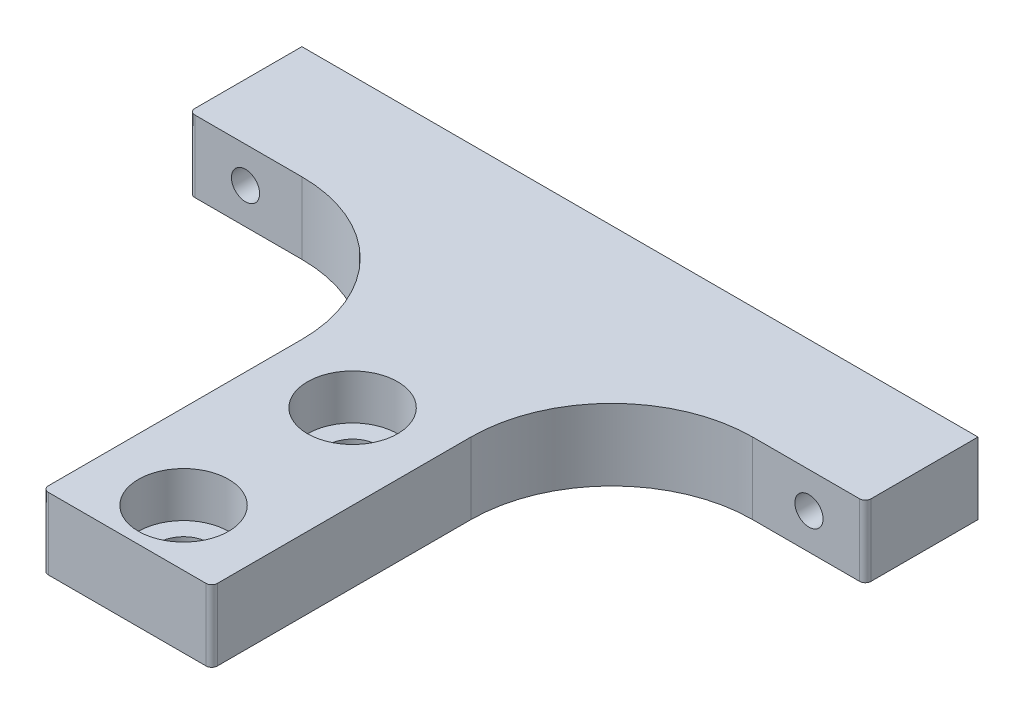
ISO-10303-21;
HEADER;
FILE_DESCRIPTION(('STEP AP214'),'2;1');
FILE_NAME('part.step','',(''),(''),'','','');
FILE_SCHEMA(('AUTOMOTIVE_DESIGN { 1 0 10303 214 1 1 1 1 }'));
ENDSEC;
DATA;
#1=APPLICATION_CONTEXT('core data for automotive mechanical design processes');
#2=APPLICATION_PROTOCOL_DEFINITION('international standard','automotive_design',2000,#1);
#3=PRODUCT_CONTEXT('',#1,'mechanical');
#4=PRODUCT('Part','Part','',(#3));
#5=PRODUCT_RELATED_PRODUCT_CATEGORY('part','',(#4));
#6=PRODUCT_DEFINITION_FORMATION('','',#4);
#7=PRODUCT_DEFINITION_CONTEXT('part definition',#1,'design');
#8=PRODUCT_DEFINITION('design','',#6,#7);
#9=PRODUCT_DEFINITION_SHAPE('','',#8);
#10=(LENGTH_UNIT() NAMED_UNIT(*) SI_UNIT(.MILLI.,.METRE.));
#11=(NAMED_UNIT(*) PLANE_ANGLE_UNIT() SI_UNIT($,.RADIAN.));
#12=(NAMED_UNIT(*) SI_UNIT($,.STERADIAN.) SOLID_ANGLE_UNIT());
#13=UNCERTAINTY_MEASURE_WITH_UNIT(LENGTH_MEASURE(1.E-05),#10,'distance_accuracy_value','');
#14=(GEOMETRIC_REPRESENTATION_CONTEXT(3) GLOBAL_UNCERTAINTY_ASSIGNED_CONTEXT((#13)) GLOBAL_UNIT_ASSIGNED_CONTEXT((#10,
#11,#12)) REPRESENTATION_CONTEXT('',''));
#15=CARTESIAN_POINT('',(0.,0.,0.));
#16=DIRECTION('',(0.,0.,1.));
#17=DIRECTION('',(1.,0.,0.));
#18=AXIS2_PLACEMENT_3D('',#15,#16,#17);
#19=CARTESIAN_POINT('',(-30.,6.35,0.));
#20=DIRECTION('',(0.,0.,1.));
#21=DIRECTION('',(1.,0.,0.));
#22=AXIS2_PLACEMENT_3D('',#19,#20,#21);
#23=PLANE('',#22);
#24=DIRECTION('',(-1.,0.,0.));
#25=VECTOR('',#24,1.);
#26=CARTESIAN_POINT('',(-30.,0.,0.));
#27=LINE('',#26,#25);
#28=CARTESIAN_POINT('',(30.,0.,0.));
#29=VERTEX_POINT('',#28);
#30=CARTESIAN_POINT('',(-30.,0.,0.));
#31=VERTEX_POINT('',#30);
#32=EDGE_CURVE('E187',#29,#31,#27,.T.);
#33=ORIENTED_EDGE('',*,*,#32,.T.);
#34=DIRECTION('',(0.,-1.,0.));
#35=VECTOR('',#34,1.);
#36=CARTESIAN_POINT('',(-30.,6.35,0.));
#37=LINE('',#36,#35);
#38=CARTESIAN_POINT('',(-30.,6.35,0.));
#39=VERTEX_POINT('',#38);
#40=EDGE_CURVE('E164',#39,#31,#37,.T.);
#41=ORIENTED_EDGE('',*,*,#40,.F.);
#42=DIRECTION('',(-1.,0.,0.));
#43=VECTOR('',#42,1.);
#44=CARTESIAN_POINT('',(-30.,6.35,0.));
#45=LINE('',#44,#43);
#46=CARTESIAN_POINT('',(30.,6.35,0.));
#47=VERTEX_POINT('',#46);
#48=EDGE_CURVE('E146',#47,#39,#45,.T.);
#49=ORIENTED_EDGE('',*,*,#48,.F.);
#50=DIRECTION('',(0.,-1.,0.));
#51=VECTOR('',#50,1.);
#52=CARTESIAN_POINT('',(30.,6.35,0.));
#53=LINE('',#52,#51);
#54=EDGE_CURVE('E157',#47,#29,#53,.T.);
#55=ORIENTED_EDGE('',*,*,#54,.T.);
#56=EDGE_LOOP('',(#33,#41,#49,#55));
#57=FACE_BOUND('',#56,.T.);
#58=CARTESIAN_POINT('',(25.,3.175,0.));
#59=DIRECTION('',(0.,0.,-1.));
#60=DIRECTION('',(-1.,0.,0.));
#61=AXIS2_PLACEMENT_3D('',#58,#59,#60);
#62=CIRCLE('',#61,1.24999999999999);
#63=CARTESIAN_POINT('',(23.75,3.175,0.));
#64=VERTEX_POINT('',#63);
#65=EDGE_CURVE('E504',#64,#64,#62,.T.);
#66=ORIENTED_EDGE('',*,*,#65,.F.);
#67=EDGE_LOOP('',(#66));
#68=FACE_BOUND('',#67,.T.);
#69=CARTESIAN_POINT('',(-25.,3.175,0.));
#70=DIRECTION('',(0.,0.,-1.));
#71=DIRECTION('',(-1.,0.,0.));
#72=AXIS2_PLACEMENT_3D('',#69,#70,#71);
#73=CIRCLE('',#72,1.24999999999999);
#74=CARTESIAN_POINT('',(-26.25,3.175,0.));
#75=VERTEX_POINT('',#74);
#76=EDGE_CURVE('E505',#75,#75,#73,.T.);
#77=ORIENTED_EDGE('',*,*,#76,.F.);
#78=EDGE_LOOP('',(#77));
#79=FACE_BOUND('',#78,.T.);
#80=ADVANCED_FACE('F39',(#57,#68,#79),#23,.F.);
#81=CARTESIAN_POINT('',(-7.5,6.35,10.));
#82=DIRECTION('',(1.,0.,0.));
#83=DIRECTION('',(0.,0.,-1.));
#84=AXIS2_PLACEMENT_3D('',#81,#82,#83);
#85=PLANE('',#84);
#86=DIRECTION('',(0.,0.,1.));
#87=VECTOR('',#86,1.);
#88=CARTESIAN_POINT('',(-7.5,0.,10.));
#89=LINE('',#88,#87);
#90=CARTESIAN_POINT('',(-7.5,0.,22.5));
#91=VERTEX_POINT('',#90);
#92=CARTESIAN_POINT('',(-7.49999999999999,0.,45.));
#93=VERTEX_POINT('',#92);
#94=EDGE_CURVE('E176',#91,#93,#89,.T.);
#95=ORIENTED_EDGE('',*,*,#94,.T.);
#96=DIRECTION('',(0.,-1.,0.));
#97=VECTOR('',#96,1.);
#98=CARTESIAN_POINT('',(-7.49999999999999,6.35,45.));
#99=LINE('',#98,#97);
#100=CARTESIAN_POINT('',(-7.49999999999999,6.35,45.));
#101=VERTEX_POINT('',#100);
#102=EDGE_CURVE('E11',#93,#101,#99,.F.);
#103=ORIENTED_EDGE('',*,*,#102,.T.);
#104=DIRECTION('',(0.,0.,1.));
#105=VECTOR('',#104,1.);
#106=CARTESIAN_POINT('',(-7.5,6.35,10.));
#107=LINE('',#106,#105);
#108=CARTESIAN_POINT('',(-7.5,6.35,22.5));
#109=VERTEX_POINT('',#108);
#110=EDGE_CURVE('E194',#109,#101,#107,.T.);
#111=ORIENTED_EDGE('',*,*,#110,.F.);
#112=DIRECTION('',(0.,-1.,0.));
#113=VECTOR('',#112,1.);
#114=CARTESIAN_POINT('',(-7.5,0.,22.5));
#115=LINE('',#114,#113);
#116=EDGE_CURVE('E201',#109,#91,#115,.T.);
#117=ORIENTED_EDGE('',*,*,#116,.T.);
#118=EDGE_LOOP('',(#95,#103,#111,#117));
#119=FACE_BOUND('',#118,.T.);
#120=ADVANCED_FACE('F266',(#119),#85,.F.);
#121=CARTESIAN_POINT('',(-7.49999999999999,6.35,45.5));
#122=DIRECTION('',(0.,0.,-1.));
#123=DIRECTION('',(-1.,0.,0.));
#124=AXIS2_PLACEMENT_3D('',#121,#122,#123);
#125=PLANE('',#124);
#126=DIRECTION('',(1.,0.,0.));
#127=VECTOR('',#126,1.);
#128=CARTESIAN_POINT('',(-7.49999999999999,0.,45.5));
#129=LINE('',#128,#127);
#130=CARTESIAN_POINT('',(-6.99999999999999,0.,45.5));
#131=VERTEX_POINT('',#130);
#132=CARTESIAN_POINT('',(7.,0.,45.5));
#133=VERTEX_POINT('',#132);
#134=EDGE_CURVE('E178',#131,#133,#129,.T.);
#135=ORIENTED_EDGE('',*,*,#134,.T.);
#136=DIRECTION('',(0.,-1.,0.));
#137=VECTOR('',#136,1.);
#138=CARTESIAN_POINT('',(7.,6.35,45.5));
#139=LINE('',#138,#137);
#140=CARTESIAN_POINT('',(7.,6.35,45.5));
#141=VERTEX_POINT('',#140);
#142=EDGE_CURVE('E60',#133,#141,#139,.F.);
#143=ORIENTED_EDGE('',*,*,#142,.T.);
#144=DIRECTION('',(1.,0.,0.));
#145=VECTOR('',#144,1.);
#146=CARTESIAN_POINT('',(-7.49999999999999,6.35,45.5));
#147=LINE('',#146,#145);
#148=CARTESIAN_POINT('',(-6.99999999999999,6.35,45.5));
#149=VERTEX_POINT('',#148);
#150=EDGE_CURVE('E248',#149,#141,#147,.T.);
#151=ORIENTED_EDGE('',*,*,#150,.F.);
#152=DIRECTION('',(0.,-1.,0.));
#153=VECTOR('',#152,1.);
#154=CARTESIAN_POINT('',(-6.99999999999999,6.35,45.5));
#155=LINE('',#154,#153);
#156=EDGE_CURVE('E240',#149,#131,#155,.T.);
#157=ORIENTED_EDGE('',*,*,#156,.T.);
#158=EDGE_LOOP('',(#135,#143,#151,#157));
#159=FACE_BOUND('',#158,.T.);
#160=ADVANCED_FACE('F261',(#159),#125,.F.);
#161=CARTESIAN_POINT('',(7.5,6.35,10.));
#162=DIRECTION('',(-1.,0.,0.));
#163=DIRECTION('',(0.,0.,1.));
#164=AXIS2_PLACEMENT_3D('',#161,#162,#163);
#165=PLANE('',#164);
#166=DIRECTION('',(0.,0.,-1.));
#167=VECTOR('',#166,1.);
#168=CARTESIAN_POINT('',(7.5,6.35,10.));
#169=LINE('',#168,#167);
#170=CARTESIAN_POINT('',(7.50000000000001,6.35,45.));
#171=VERTEX_POINT('',#170);
#172=CARTESIAN_POINT('',(7.5,6.35,22.5));
#173=VERTEX_POINT('',#172);
#174=EDGE_CURVE('E247',#171,#173,#169,.T.);
#175=ORIENTED_EDGE('',*,*,#174,.F.);
#176=DIRECTION('',(0.,-1.,0.));
#177=VECTOR('',#176,1.);
#178=CARTESIAN_POINT('',(7.50000000000001,6.35,45.));
#179=LINE('',#178,#177);
#180=CARTESIAN_POINT('',(7.50000000000001,0.,45.));
#181=VERTEX_POINT('',#180);
#182=EDGE_CURVE('E233',#171,#181,#179,.T.);
#183=ORIENTED_EDGE('',*,*,#182,.T.);
#184=DIRECTION('',(0.,0.,-1.));
#185=VECTOR('',#184,1.);
#186=CARTESIAN_POINT('',(7.5,0.,10.));
#187=LINE('',#186,#185);
#188=CARTESIAN_POINT('',(7.5,0.,22.5));
#189=VERTEX_POINT('',#188);
#190=EDGE_CURVE('E181',#181,#189,#187,.T.);
#191=ORIENTED_EDGE('',*,*,#190,.T.);
#192=DIRECTION('',(0.,-1.,0.));
#193=VECTOR('',#192,1.);
#194=CARTESIAN_POINT('',(7.5,6.35,22.5));
#195=LINE('',#194,#193);
#196=EDGE_CURVE('E198',#189,#173,#195,.F.);
#197=ORIENTED_EDGE('',*,*,#196,.T.);
#198=EDGE_LOOP('',(#175,#183,#191,#197));
#199=FACE_BOUND('',#198,.T.);
#200=ADVANCED_FACE('F252',(#199),#165,.F.);
#201=CARTESIAN_POINT('',(30.,6.35,9.99999999999999));
#202=DIRECTION('',(0.,0.,-1.));
#203=DIRECTION('',(-1.,0.,0.));
#204=AXIS2_PLACEMENT_3D('',#201,#202,#203);
#205=PLANE('',#204);
#206=CARTESIAN_POINT('',(25.,3.175,9.99999999999999));
#207=DIRECTION('',(0.,0.,-1.));
#208=DIRECTION('',(-1.,0.,0.));
#209=AXIS2_PLACEMENT_3D('',#206,#207,#208);
#210=CIRCLE('',#209,1.25);
#211=CARTESIAN_POINT('',(23.75,3.175,9.99999999999999));
#212=VERTEX_POINT('',#211);
#213=EDGE_CURVE('E508',#212,#212,#210,.T.);
#214=ORIENTED_EDGE('',*,*,#213,.T.);
#215=EDGE_LOOP('',(#214));
#216=FACE_BOUND('',#215,.T.);
#217=DIRECTION('',(1.,0.,0.));
#218=VECTOR('',#217,1.);
#219=CARTESIAN_POINT('',(30.,0.,9.99999999999999));
#220=LINE('',#219,#218);
#221=CARTESIAN_POINT('',(20.,0.,10.));
#222=VERTEX_POINT('',#221);
#223=CARTESIAN_POINT('',(29.5,0.,9.99999999999999));
#224=VERTEX_POINT('',#223);
#225=EDGE_CURVE('E183',#222,#224,#220,.T.);
#226=ORIENTED_EDGE('',*,*,#225,.T.);
#227=DIRECTION('',(0.,-1.,0.));
#228=VECTOR('',#227,1.);
#229=CARTESIAN_POINT('',(29.5,6.35,9.99999999999999));
#230=LINE('',#229,#228);
#231=CARTESIAN_POINT('',(29.5,6.35,9.99999999999999));
#232=VERTEX_POINT('',#231);
#233=EDGE_CURVE('E223',#224,#232,#230,.F.);
#234=ORIENTED_EDGE('',*,*,#233,.T.);
#235=DIRECTION('',(1.,0.,0.));
#236=VECTOR('',#235,1.);
#237=CARTESIAN_POINT('',(30.,6.35,9.99999999999999));
#238=LINE('',#237,#236);
#239=CARTESIAN_POINT('',(20.,6.35,10.));
#240=VERTEX_POINT('',#239);
#241=EDGE_CURVE('E154',#240,#232,#238,.T.);
#242=ORIENTED_EDGE('',*,*,#241,.F.);
#243=DIRECTION('',(0.,-1.,0.));
#244=VECTOR('',#243,1.);
#245=CARTESIAN_POINT('',(20.,0.,10.));
#246=LINE('',#245,#244);
#247=EDGE_CURVE('E163',#240,#222,#246,.T.);
#248=ORIENTED_EDGE('',*,*,#247,.T.);
#249=EDGE_LOOP('',(#226,#234,#242,#248));
#250=FACE_BOUND('',#249,.T.);
#251=ADVANCED_FACE('F295',(#216,#250),#205,.F.);
#252=CARTESIAN_POINT('',(30.,6.35,0.));
#253=DIRECTION('',(-1.,0.,0.));
#254=DIRECTION('',(0.,0.,1.));
#255=AXIS2_PLACEMENT_3D('',#252,#253,#254);
#256=PLANE('',#255);
#257=DIRECTION('',(0.,0.,-1.));
#258=VECTOR('',#257,1.);
#259=CARTESIAN_POINT('',(30.,6.35,0.));
#260=LINE('',#259,#258);
#261=CARTESIAN_POINT('',(30.,6.35,9.49999999999999));
#262=VERTEX_POINT('',#261);
#263=EDGE_CURVE('E141',#262,#47,#260,.T.);
#264=ORIENTED_EDGE('',*,*,#263,.F.);
#265=DIRECTION('',(0.,-1.,0.));
#266=VECTOR('',#265,1.);
#267=CARTESIAN_POINT('',(30.,6.35,9.49999999999999));
#268=LINE('',#267,#266);
#269=CARTESIAN_POINT('',(30.,0.,9.49999999999999));
#270=VERTEX_POINT('',#269);
#271=EDGE_CURVE('E217',#262,#270,#268,.T.);
#272=ORIENTED_EDGE('',*,*,#271,.T.);
#273=DIRECTION('',(0.,0.,-1.));
#274=VECTOR('',#273,1.);
#275=CARTESIAN_POINT('',(30.,0.,0.));
#276=LINE('',#275,#274);
#277=EDGE_CURVE('E160',#270,#29,#276,.T.);
#278=ORIENTED_EDGE('',*,*,#277,.T.);
#279=ORIENTED_EDGE('',*,*,#54,.F.);
#280=EDGE_LOOP('',(#264,#272,#278,#279));
#281=FACE_BOUND('',#280,.T.);
#282=ADVANCED_FACE('F158',(#281),#256,.F.);
#283=CARTESIAN_POINT('',(-30.,6.35,0.));
#284=DIRECTION('',(1.,0.,0.));
#285=DIRECTION('',(0.,0.,-1.));
#286=AXIS2_PLACEMENT_3D('',#283,#284,#285);
#287=PLANE('',#286);
#288=DIRECTION('',(0.,0.,1.));
#289=VECTOR('',#288,1.);
#290=CARTESIAN_POINT('',(-30.,0.,0.));
#291=LINE('',#290,#289);
#292=CARTESIAN_POINT('',(-30.,0.,9.5));
#293=VERTEX_POINT('',#292);
#294=EDGE_CURVE('E189',#31,#293,#291,.T.);
#295=ORIENTED_EDGE('',*,*,#294,.T.);
#296=DIRECTION('',(0.,-1.,0.));
#297=VECTOR('',#296,1.);
#298=CARTESIAN_POINT('',(-30.,6.35,9.5));
#299=LINE('',#298,#297);
#300=CARTESIAN_POINT('',(-30.,6.35,9.5));
#301=VERTEX_POINT('',#300);
#302=EDGE_CURVE('E231',#293,#301,#299,.F.);
#303=ORIENTED_EDGE('',*,*,#302,.T.);
#304=DIRECTION('',(0.,0.,1.));
#305=VECTOR('',#304,1.);
#306=CARTESIAN_POINT('',(-30.,6.35,0.));
#307=LINE('',#306,#305);
#308=EDGE_CURVE('E169',#39,#301,#307,.T.);
#309=ORIENTED_EDGE('',*,*,#308,.F.);
#310=ORIENTED_EDGE('',*,*,#40,.T.);
#311=EDGE_LOOP('',(#295,#303,#309,#310));
#312=FACE_BOUND('',#311,.T.);
#313=ADVANCED_FACE('F283',(#312),#287,.F.);
#314=CARTESIAN_POINT('',(-30.,6.35,10.));
#315=DIRECTION('',(0.,0.,-1.));
#316=DIRECTION('',(-1.,0.,0.));
#317=AXIS2_PLACEMENT_3D('',#314,#315,#316);
#318=PLANE('',#317);
#319=CARTESIAN_POINT('',(-25.,3.175,10.));
#320=DIRECTION('',(0.,0.,-1.));
#321=DIRECTION('',(-1.,0.,0.));
#322=AXIS2_PLACEMENT_3D('',#319,#320,#321);
#323=CIRCLE('',#322,1.25);
#324=CARTESIAN_POINT('',(-26.25,3.175,10.));
#325=VERTEX_POINT('',#324);
#326=EDGE_CURVE('E503',#325,#325,#323,.T.);
#327=ORIENTED_EDGE('',*,*,#326,.T.);
#328=EDGE_LOOP('',(#327));
#329=FACE_BOUND('',#328,.T.);
#330=DIRECTION('',(1.,0.,0.));
#331=VECTOR('',#330,1.);
#332=CARTESIAN_POINT('',(-30.,6.35,10.));
#333=LINE('',#332,#331);
#334=CARTESIAN_POINT('',(-29.5,6.35,10.));
#335=VERTEX_POINT('',#334);
#336=CARTESIAN_POINT('',(-20.,6.35,10.));
#337=VERTEX_POINT('',#336);
#338=EDGE_CURVE('E171',#335,#337,#333,.T.);
#339=ORIENTED_EDGE('',*,*,#338,.F.);
#340=DIRECTION('',(0.,-1.,0.));
#341=VECTOR('',#340,1.);
#342=CARTESIAN_POINT('',(-29.5,6.35,10.));
#343=LINE('',#342,#341);
#344=CARTESIAN_POINT('',(-29.5,0.,10.));
#345=VERTEX_POINT('',#344);
#346=EDGE_CURVE('E228',#335,#345,#343,.T.);
#347=ORIENTED_EDGE('',*,*,#346,.T.);
#348=DIRECTION('',(1.,0.,0.));
#349=VECTOR('',#348,1.);
#350=CARTESIAN_POINT('',(-30.,0.,10.));
#351=LINE('',#350,#349);
#352=CARTESIAN_POINT('',(-20.,0.,10.));
#353=VERTEX_POINT('',#352);
#354=EDGE_CURVE('E192',#345,#353,#351,.T.);
#355=ORIENTED_EDGE('',*,*,#354,.T.);
#356=DIRECTION('',(0.,-1.,0.));
#357=VECTOR('',#356,1.);
#358=CARTESIAN_POINT('',(-20.,6.35,10.));
#359=LINE('',#358,#357);
#360=EDGE_CURVE('E204',#353,#337,#359,.F.);
#361=ORIENTED_EDGE('',*,*,#360,.T.);
#362=EDGE_LOOP('',(#339,#347,#355,#361));
#363=FACE_BOUND('',#362,.T.);
#364=ADVANCED_FACE('F276',(#329,#363),#318,.F.);
#365=CARTESIAN_POINT('',(0.,6.35,0.));
#366=DIRECTION('',(0.,1.,0.));
#367=DIRECTION('',(0.,0.,1.));
#368=AXIS2_PLACEMENT_3D('',#365,#366,#367);
#369=PLANE('',#368);
#370=CARTESIAN_POINT('',(0.,6.35,25.5));
#371=DIRECTION('',(0.,1.,0.));
#372=DIRECTION('',(0.,0.,1.));
#373=AXIS2_PLACEMENT_3D('',#370,#371,#372);
#374=CIRCLE('',#373,4.);
#375=CARTESIAN_POINT('',(0.,6.35,29.5));
#376=VERTEX_POINT('',#375);
#377=EDGE_CURVE('E515',#376,#376,#374,.T.);
#378=ORIENTED_EDGE('',*,*,#377,.F.);
#379=EDGE_LOOP('',(#378));
#380=FACE_BOUND('',#379,.T.);
#381=CARTESIAN_POINT('',(0.,6.35,40.5));
#382=DIRECTION('',(0.,1.,0.));
#383=DIRECTION('',(0.,0.,1.));
#384=AXIS2_PLACEMENT_3D('',#381,#382,#383);
#385=CIRCLE('',#384,4.);
#386=CARTESIAN_POINT('',(0.,6.35,44.5));
#387=VERTEX_POINT('',#386);
#388=EDGE_CURVE('E527',#387,#387,#385,.T.);
#389=ORIENTED_EDGE('',*,*,#388,.F.);
#390=EDGE_LOOP('',(#389));
#391=FACE_BOUND('',#390,.T.);
#392=ORIENTED_EDGE('',*,*,#150,.T.);
#393=CARTESIAN_POINT('',(7.00000000000001,6.35,45.));
#394=DIRECTION('',(0.,1.,0.));
#395=DIRECTION('',(0.,0.,1.));
#396=AXIS2_PLACEMENT_3D('',#393,#394,#395);
#397=CIRCLE('',#396,0.5);
#398=EDGE_CURVE('E47',#141,#171,#397,.T.);
#399=ORIENTED_EDGE('',*,*,#398,.T.);
#400=ORIENTED_EDGE('',*,*,#174,.T.);
#401=CARTESIAN_POINT('',(20.,6.35,22.5));
#402=DIRECTION('',(0.,1.,0.));
#403=DIRECTION('',(0.,0.,1.));
#404=AXIS2_PLACEMENT_3D('',#401,#402,#403);
#405=CIRCLE('',#404,12.5);
#406=EDGE_CURVE('E210',#173,#240,#405,.F.);
#407=ORIENTED_EDGE('',*,*,#406,.T.);
#408=ORIENTED_EDGE('',*,*,#241,.T.);
#409=CARTESIAN_POINT('',(29.5,6.35,9.49999999999999));
#410=DIRECTION('',(0.,1.,0.));
#411=DIRECTION('',(0.,0.,1.));
#412=AXIS2_PLACEMENT_3D('',#409,#410,#411);
#413=CIRCLE('',#412,0.5);
#414=EDGE_CURVE('E150',#232,#262,#413,.T.);
#415=ORIENTED_EDGE('',*,*,#414,.T.);
#416=ORIENTED_EDGE('',*,*,#263,.T.);
#417=ORIENTED_EDGE('',*,*,#48,.T.);
#418=ORIENTED_EDGE('',*,*,#308,.T.);
#419=CARTESIAN_POINT('',(-29.5,6.35,9.5));
#420=DIRECTION('',(0.,1.,0.));
#421=DIRECTION('',(0.,0.,1.));
#422=AXIS2_PLACEMENT_3D('',#419,#420,#421);
#423=CIRCLE('',#422,0.5);
#424=EDGE_CURVE('E225',#301,#335,#423,.T.);
#425=ORIENTED_EDGE('',*,*,#424,.T.);
#426=ORIENTED_EDGE('',*,*,#338,.T.);
#427=CARTESIAN_POINT('',(-20.,6.35,22.5));
#428=DIRECTION('',(0.,1.,0.));
#429=DIRECTION('',(0.,0.,1.));
#430=AXIS2_PLACEMENT_3D('',#427,#428,#429);
#431=CIRCLE('',#430,12.5);
#432=EDGE_CURVE('E215',#337,#109,#431,.F.);
#433=ORIENTED_EDGE('',*,*,#432,.T.);
#434=ORIENTED_EDGE('',*,*,#110,.T.);
#435=CARTESIAN_POINT('',(-6.99999999999999,6.35,45.));
#436=DIRECTION('',(0.,1.,0.));
#437=DIRECTION('',(0.,0.,1.));
#438=AXIS2_PLACEMENT_3D('',#435,#436,#437);
#439=CIRCLE('',#438,0.5);
#440=EDGE_CURVE('E244',#101,#149,#439,.T.);
#441=ORIENTED_EDGE('',*,*,#440,.T.);
#442=EDGE_LOOP('',(#392,#399,#400,#407,#408,#415,#416,#417,#418,#425,#426,#433,#434,#441));
#443=FACE_BOUND('',#442,.T.);
#444=ADVANCED_FACE('F143',(#380,#391,#443),#369,.T.);
#445=CARTESIAN_POINT('',(0.,0.,0.));
#446=DIRECTION('',(0.,1.,0.));
#447=DIRECTION('',(0.,0.,1.));
#448=AXIS2_PLACEMENT_3D('',#445,#446,#447);
#449=PLANE('',#448);
#450=CARTESIAN_POINT('',(0.,0.,25.5));
#451=DIRECTION('',(0.,1.,0.));
#452=DIRECTION('',(0.,0.,1.));
#453=AXIS2_PLACEMENT_3D('',#450,#451,#452);
#454=CIRCLE('',#453,2.25);
#455=CARTESIAN_POINT('',(0.,0.,27.75));
#456=VERTEX_POINT('',#455);
#457=EDGE_CURVE('E524',#456,#456,#454,.T.);
#458=ORIENTED_EDGE('',*,*,#457,.T.);
#459=EDGE_LOOP('',(#458));
#460=FACE_BOUND('',#459,.T.);
#461=CARTESIAN_POINT('',(0.,0.,40.5));
#462=DIRECTION('',(0.,1.,0.));
#463=DIRECTION('',(0.,0.,1.));
#464=AXIS2_PLACEMENT_3D('',#461,#462,#463);
#465=CIRCLE('',#464,2.25);
#466=CARTESIAN_POINT('',(0.,0.,42.75));
#467=VERTEX_POINT('',#466);
#468=EDGE_CURVE('E179',#467,#467,#465,.T.);
#469=ORIENTED_EDGE('',*,*,#468,.T.);
#470=EDGE_LOOP('',(#469));
#471=FACE_BOUND('',#470,.T.);
#472=ORIENTED_EDGE('',*,*,#190,.F.);
#473=CARTESIAN_POINT('',(7.00000000000001,0.,45.));
#474=DIRECTION('',(0.,1.,0.));
#475=DIRECTION('',(0.,0.,1.));
#476=AXIS2_PLACEMENT_3D('',#473,#474,#475);
#477=CIRCLE('',#476,0.5);
#478=EDGE_CURVE('E238',#181,#133,#477,.F.);
#479=ORIENTED_EDGE('',*,*,#478,.T.);
#480=ORIENTED_EDGE('',*,*,#134,.F.);
#481=CARTESIAN_POINT('',(-6.99999999999999,0.,45.));
#482=DIRECTION('',(0.,1.,0.));
#483=DIRECTION('',(0.,0.,1.));
#484=AXIS2_PLACEMENT_3D('',#481,#482,#483);
#485=CIRCLE('',#484,0.5);
#486=EDGE_CURVE('E236',#131,#93,#485,.F.);
#487=ORIENTED_EDGE('',*,*,#486,.T.);
#488=ORIENTED_EDGE('',*,*,#94,.F.);
#489=CARTESIAN_POINT('',(-20.,0.,22.5));
#490=DIRECTION('',(0.,1.,0.));
#491=DIRECTION('',(0.,0.,1.));
#492=AXIS2_PLACEMENT_3D('',#489,#490,#491);
#493=CIRCLE('',#492,12.5);
#494=EDGE_CURVE('E212',#91,#353,#493,.T.);
#495=ORIENTED_EDGE('',*,*,#494,.T.);
#496=ORIENTED_EDGE('',*,*,#354,.F.);
#497=CARTESIAN_POINT('',(-29.5,0.,9.5));
#498=DIRECTION('',(0.,1.,0.));
#499=DIRECTION('',(0.,0.,1.));
#500=AXIS2_PLACEMENT_3D('',#497,#498,#499);
#501=CIRCLE('',#500,0.5);
#502=EDGE_CURVE('E219',#345,#293,#501,.F.);
#503=ORIENTED_EDGE('',*,*,#502,.T.);
#504=ORIENTED_EDGE('',*,*,#294,.F.);
#505=ORIENTED_EDGE('',*,*,#32,.F.);
#506=ORIENTED_EDGE('',*,*,#277,.F.);
#507=CARTESIAN_POINT('',(29.5,0.,9.49999999999999));
#508=DIRECTION('',(0.,1.,0.));
#509=DIRECTION('',(0.,0.,1.));
#510=AXIS2_PLACEMENT_3D('',#507,#508,#509);
#511=CIRCLE('',#510,0.5);
#512=EDGE_CURVE('E221',#270,#224,#511,.F.);
#513=ORIENTED_EDGE('',*,*,#512,.T.);
#514=ORIENTED_EDGE('',*,*,#225,.F.);
#515=CARTESIAN_POINT('',(20.,0.,22.5));
#516=DIRECTION('',(0.,1.,0.));
#517=DIRECTION('',(0.,0.,1.));
#518=AXIS2_PLACEMENT_3D('',#515,#516,#517);
#519=CIRCLE('',#518,12.5);
#520=EDGE_CURVE('E207',#222,#189,#519,.T.);
#521=ORIENTED_EDGE('',*,*,#520,.T.);
#522=EDGE_LOOP('',(#472,#479,#480,#487,#488,#495,#496,#503,#504,#505,#506,#513,#514,#521));
#523=FACE_BOUND('',#522,.T.);
#524=ADVANCED_FACE('F260',(#460,#471,#523),#449,.F.);
#525=CARTESIAN_POINT('',(20.,6.35,22.5));
#526=DIRECTION('',(0.,1.,0.));
#527=DIRECTION('',(0.,0.,1.));
#528=AXIS2_PLACEMENT_3D('',#525,#526,#527);
#529=CYLINDRICAL_SURFACE('',#528,12.5);
#530=ORIENTED_EDGE('',*,*,#406,.F.);
#531=ORIENTED_EDGE('',*,*,#196,.F.);
#532=ORIENTED_EDGE('',*,*,#520,.F.);
#533=ORIENTED_EDGE('',*,*,#247,.F.);
#534=EDGE_LOOP('',(#530,#531,#532,#533));
#535=FACE_BOUND('',#534,.T.);
#536=ADVANCED_FACE('F297',(#535),#529,.F.);
#537=CARTESIAN_POINT('',(-20.,6.35,22.5));
#538=DIRECTION('',(0.,1.,0.));
#539=DIRECTION('',(0.,0.,1.));
#540=AXIS2_PLACEMENT_3D('',#537,#538,#539);
#541=CYLINDRICAL_SURFACE('',#540,12.5);
#542=ORIENTED_EDGE('',*,*,#432,.F.);
#543=ORIENTED_EDGE('',*,*,#360,.F.);
#544=ORIENTED_EDGE('',*,*,#494,.F.);
#545=ORIENTED_EDGE('',*,*,#116,.F.);
#546=EDGE_LOOP('',(#542,#543,#544,#545));
#547=FACE_BOUND('',#546,.T.);
#548=ADVANCED_FACE('F270',(#547),#541,.F.);
#549=CARTESIAN_POINT('',(0.,6.35,40.5));
#550=DIRECTION('',(0.,1.,0.));
#551=DIRECTION('',(0.,0.,1.));
#552=AXIS2_PLACEMENT_3D('',#549,#550,#551);
#553=CYLINDRICAL_SURFACE('',#552,2.25);
#554=ORIENTED_EDGE('',*,*,#468,.F.);
#555=EDGE_LOOP('',(#554));
#556=FACE_BOUND('',#555,.T.);
#557=CARTESIAN_POINT('',(0.,2.35,40.5));
#558=DIRECTION('',(0.,1.,0.));
#559=DIRECTION('',(0.,0.,1.));
#560=AXIS2_PLACEMENT_3D('',#557,#558,#559);
#561=CIRCLE('',#560,2.25);
#562=CARTESIAN_POINT('',(0.,2.35,42.75));
#563=VERTEX_POINT('',#562);
#564=EDGE_CURVE('E532',#563,#563,#561,.T.);
#565=ORIENTED_EDGE('',*,*,#564,.T.);
#566=EDGE_LOOP('',(#565));
#567=FACE_BOUND('',#566,.T.);
#568=ADVANCED_FACE('F303',(#556,#567),#553,.F.);
#569=CARTESIAN_POINT('',(2.25,2.35,40.5));
#570=DIRECTION('',(0.,-1.,0.));
#571=DIRECTION('',(0.,0.,-1.));
#572=AXIS2_PLACEMENT_3D('',#569,#570,#571);
#573=PLANE('',#572);
#574=ORIENTED_EDGE('',*,*,#564,.F.);
#575=EDGE_LOOP('',(#574));
#576=FACE_BOUND('',#575,.T.);
#577=CARTESIAN_POINT('',(0.,2.35,40.5));
#578=DIRECTION('',(0.,1.,0.));
#579=DIRECTION('',(0.,0.,1.));
#580=AXIS2_PLACEMENT_3D('',#577,#578,#579);
#581=CIRCLE('',#580,4.);
#582=CARTESIAN_POINT('',(0.,2.35,44.5));
#583=VERTEX_POINT('',#582);
#584=EDGE_CURVE('E530',#583,#583,#581,.T.);
#585=ORIENTED_EDGE('',*,*,#584,.T.);
#586=EDGE_LOOP('',(#585));
#587=FACE_BOUND('',#586,.T.);
#588=ADVANCED_FACE('F435',(#576,#587),#573,.F.);
#589=CARTESIAN_POINT('',(0.,6.35,40.5));
#590=DIRECTION('',(0.,1.,0.));
#591=DIRECTION('',(0.,0.,1.));
#592=AXIS2_PLACEMENT_3D('',#589,#590,#591);
#593=CYLINDRICAL_SURFACE('',#592,4.);
#594=ORIENTED_EDGE('',*,*,#584,.F.);
#595=EDGE_LOOP('',(#594));
#596=FACE_BOUND('',#595,.T.);
#597=ORIENTED_EDGE('',*,*,#388,.T.);
#598=EDGE_LOOP('',(#597));
#599=FACE_BOUND('',#598,.T.);
#600=ADVANCED_FACE('F426',(#596,#599),#593,.F.);
#601=CARTESIAN_POINT('',(0.,6.35,25.5));
#602=DIRECTION('',(0.,1.,0.));
#603=DIRECTION('',(0.,0.,1.));
#604=AXIS2_PLACEMENT_3D('',#601,#602,#603);
#605=CYLINDRICAL_SURFACE('',#604,2.25);
#606=ORIENTED_EDGE('',*,*,#457,.F.);
#607=EDGE_LOOP('',(#606));
#608=FACE_BOUND('',#607,.T.);
#609=CARTESIAN_POINT('',(0.,2.35,25.5));
#610=DIRECTION('',(0.,1.,0.));
#611=DIRECTION('',(0.,0.,1.));
#612=AXIS2_PLACEMENT_3D('',#609,#610,#611);
#613=CIRCLE('',#612,2.25);
#614=CARTESIAN_POINT('',(0.,2.35,27.75));
#615=VERTEX_POINT('',#614);
#616=EDGE_CURVE('E521',#615,#615,#613,.T.);
#617=ORIENTED_EDGE('',*,*,#616,.T.);
#618=EDGE_LOOP('',(#617));
#619=FACE_BOUND('',#618,.T.);
#620=ADVANCED_FACE('F417',(#608,#619),#605,.F.);
#621=CARTESIAN_POINT('',(2.25,2.35,25.5));
#622=DIRECTION('',(0.,-1.,0.));
#623=DIRECTION('',(0.,0.,-1.));
#624=AXIS2_PLACEMENT_3D('',#621,#622,#623);
#625=PLANE('',#624);
#626=ORIENTED_EDGE('',*,*,#616,.F.);
#627=EDGE_LOOP('',(#626));
#628=FACE_BOUND('',#627,.T.);
#629=CARTESIAN_POINT('',(0.,2.35,25.5));
#630=DIRECTION('',(0.,1.,0.));
#631=DIRECTION('',(0.,0.,1.));
#632=AXIS2_PLACEMENT_3D('',#629,#630,#631);
#633=CIRCLE('',#632,4.);
#634=CARTESIAN_POINT('',(0.,2.35,29.5));
#635=VERTEX_POINT('',#634);
#636=EDGE_CURVE('E518',#635,#635,#633,.T.);
#637=ORIENTED_EDGE('',*,*,#636,.T.);
#638=EDGE_LOOP('',(#637));
#639=FACE_BOUND('',#638,.T.);
#640=ADVANCED_FACE('F408',(#628,#639),#625,.F.);
#641=CARTESIAN_POINT('',(0.,6.35,25.5));
#642=DIRECTION('',(0.,1.,0.));
#643=DIRECTION('',(0.,0.,1.));
#644=AXIS2_PLACEMENT_3D('',#641,#642,#643);
#645=CYLINDRICAL_SURFACE('',#644,4.);
#646=ORIENTED_EDGE('',*,*,#636,.F.);
#647=EDGE_LOOP('',(#646));
#648=FACE_BOUND('',#647,.T.);
#649=ORIENTED_EDGE('',*,*,#377,.T.);
#650=EDGE_LOOP('',(#649));
#651=FACE_BOUND('',#650,.T.);
#652=ADVANCED_FACE('F396',(#648,#651),#645,.F.);
#653=CARTESIAN_POINT('',(25.,3.175,0.));
#654=DIRECTION('',(0.,0.,-1.));
#655=DIRECTION('',(-1.,0.,0.));
#656=AXIS2_PLACEMENT_3D('',#653,#654,#655);
#657=CYLINDRICAL_SURFACE('',#656,1.25);
#658=ORIENTED_EDGE('',*,*,#213,.F.);
#659=EDGE_LOOP('',(#658));
#660=FACE_BOUND('',#659,.T.);
#661=ORIENTED_EDGE('',*,*,#65,.T.);
#662=EDGE_LOOP('',(#661));
#663=FACE_BOUND('',#662,.T.);
#664=ADVANCED_FACE('F388',(#660,#663),#657,.F.);
#665=CARTESIAN_POINT('',(-25.,3.175,0.));
#666=DIRECTION('',(0.,0.,-1.));
#667=DIRECTION('',(-1.,0.,0.));
#668=AXIS2_PLACEMENT_3D('',#665,#666,#667);
#669=CYLINDRICAL_SURFACE('',#668,1.25);
#670=ORIENTED_EDGE('',*,*,#326,.F.);
#671=EDGE_LOOP('',(#670));
#672=FACE_BOUND('',#671,.T.);
#673=ORIENTED_EDGE('',*,*,#76,.T.);
#674=EDGE_LOOP('',(#673));
#675=FACE_BOUND('',#674,.T.);
#676=ADVANCED_FACE('F380',(#672,#675),#669,.F.);
#677=CARTESIAN_POINT('',(29.5,6.35,9.49999999999999));
#678=DIRECTION('',(0.,-1.,0.));
#679=DIRECTION('',(0.,0.,-1.));
#680=AXIS2_PLACEMENT_3D('',#677,#678,#679);
#681=CYLINDRICAL_SURFACE('',#680,0.5);
#682=ORIENTED_EDGE('',*,*,#414,.F.);
#683=ORIENTED_EDGE('',*,*,#233,.F.);
#684=ORIENTED_EDGE('',*,*,#512,.F.);
#685=ORIENTED_EDGE('',*,*,#271,.F.);
#686=EDGE_LOOP('',(#682,#683,#684,#685));
#687=FACE_BOUND('',#686,.T.);
#688=ADVANCED_FACE('F293',(#687),#681,.T.);
#689=CARTESIAN_POINT('',(-29.5,6.35,9.5));
#690=DIRECTION('',(0.,-1.,0.));
#691=DIRECTION('',(0.,0.,-1.));
#692=AXIS2_PLACEMENT_3D('',#689,#690,#691);
#693=CYLINDRICAL_SURFACE('',#692,0.5);
#694=ORIENTED_EDGE('',*,*,#424,.F.);
#695=ORIENTED_EDGE('',*,*,#302,.F.);
#696=ORIENTED_EDGE('',*,*,#502,.F.);
#697=ORIENTED_EDGE('',*,*,#346,.F.);
#698=EDGE_LOOP('',(#694,#695,#696,#697));
#699=FACE_BOUND('',#698,.T.);
#700=ADVANCED_FACE('F280',(#699),#693,.T.);
#701=CARTESIAN_POINT('',(7.00000000000001,6.35,45.));
#702=DIRECTION('',(0.,-1.,0.));
#703=DIRECTION('',(0.,0.,-1.));
#704=AXIS2_PLACEMENT_3D('',#701,#702,#703);
#705=CYLINDRICAL_SURFACE('',#704,0.5);
#706=ORIENTED_EDGE('',*,*,#398,.F.);
#707=ORIENTED_EDGE('',*,*,#142,.F.);
#708=ORIENTED_EDGE('',*,*,#478,.F.);
#709=ORIENTED_EDGE('',*,*,#182,.F.);
#710=EDGE_LOOP('',(#706,#707,#708,#709));
#711=FACE_BOUND('',#710,.T.);
#712=ADVANCED_FACE('F257',(#711),#705,.T.);
#713=CARTESIAN_POINT('',(-6.99999999999999,6.35,45.));
#714=DIRECTION('',(0.,-1.,0.));
#715=DIRECTION('',(0.,0.,-1.));
#716=AXIS2_PLACEMENT_3D('',#713,#714,#715);
#717=CYLINDRICAL_SURFACE('',#716,0.5);
#718=ORIENTED_EDGE('',*,*,#440,.F.);
#719=ORIENTED_EDGE('',*,*,#102,.F.);
#720=ORIENTED_EDGE('',*,*,#486,.F.);
#721=ORIENTED_EDGE('',*,*,#156,.F.);
#722=EDGE_LOOP('',(#718,#719,#720,#721));
#723=FACE_BOUND('',#722,.T.);
#724=ADVANCED_FACE('F41',(#723),#717,.T.);
#725=CLOSED_SHELL('',(#80,#120,#160,#200,#251,#282,#313,#364,#444,#524,#536,#548,#568,#588,#600,
#620,#640,#652,#664,#676,#688,#700,#712,#724));
#726=MANIFOLD_SOLID_BREP('B2',#725);
#727=ADVANCED_BREP_SHAPE_REPRESENTATION('',(#18,#726),#14);
#728=SHAPE_DEFINITION_REPRESENTATION(#9,#727);
ENDSEC;
END-ISO-10303-21;
